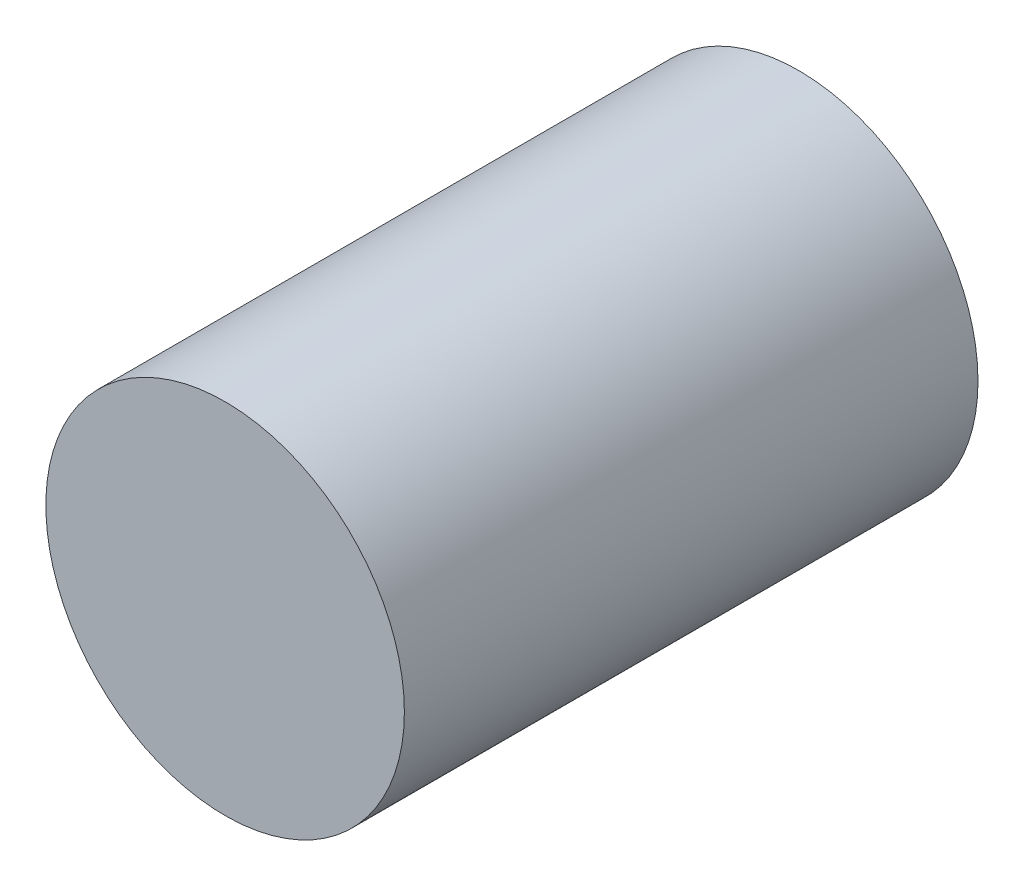
ISO-10303-21;
HEADER;
FILE_DESCRIPTION(('STEP AP214'),'2;1');
FILE_NAME('part.step','',(''),(''),'','','');
FILE_SCHEMA(('AUTOMOTIVE_DESIGN { 1 0 10303 214 1 1 1 1 }'));
ENDSEC;
DATA;
#1=APPLICATION_CONTEXT('core data for automotive mechanical design processes');
#2=APPLICATION_PROTOCOL_DEFINITION('international standard','automotive_design',2000,#1);
#3=PRODUCT_CONTEXT('',#1,'mechanical');
#4=PRODUCT('Part','Part','',(#3));
#5=PRODUCT_RELATED_PRODUCT_CATEGORY('part','',(#4));
#6=PRODUCT_DEFINITION_FORMATION('','',#4);
#7=PRODUCT_DEFINITION_CONTEXT('part definition',#1,'design');
#8=PRODUCT_DEFINITION('design','',#6,#7);
#9=PRODUCT_DEFINITION_SHAPE('','',#8);
#10=(LENGTH_UNIT() NAMED_UNIT(*) SI_UNIT(.MILLI.,.METRE.));
#11=(NAMED_UNIT(*) PLANE_ANGLE_UNIT() SI_UNIT($,.RADIAN.));
#12=(NAMED_UNIT(*) SI_UNIT($,.STERADIAN.) SOLID_ANGLE_UNIT());
#13=UNCERTAINTY_MEASURE_WITH_UNIT(LENGTH_MEASURE(1.E-05),#10,'distance_accuracy_value','');
#14=(GEOMETRIC_REPRESENTATION_CONTEXT(3) GLOBAL_UNCERTAINTY_ASSIGNED_CONTEXT((#13)) GLOBAL_UNIT_ASSIGNED_CONTEXT((#10,
#11,#12)) REPRESENTATION_CONTEXT('',''));
#15=CARTESIAN_POINT('',(0.,0.,0.));
#16=DIRECTION('',(0.,0.,1.));
#17=DIRECTION('',(1.,0.,0.));
#18=AXIS2_PLACEMENT_3D('',#15,#16,#17);
#19=CARTESIAN_POINT('',(0.,0.,80.));
#20=DIRECTION('',(0.,0.,-1.));
#21=DIRECTION('',(-1.,0.,0.));
#22=AXIS2_PLACEMENT_3D('',#19,#20,#21);
#23=CYLINDRICAL_SURFACE('',#22,25.);
#24=CARTESIAN_POINT('',(0.,0.,80.));
#25=DIRECTION('',(0.,0.,1.));
#26=DIRECTION('',(1.,0.,0.));
#27=AXIS2_PLACEMENT_3D('',#24,#25,#26);
#28=CIRCLE('',#27,25.);
#29=CARTESIAN_POINT('',(25.,0.,80.));
#30=VERTEX_POINT('',#29);
#31=EDGE_CURVE('E10',#30,#30,#28,.T.);
#32=ORIENTED_EDGE('',*,*,#31,.F.);
#33=EDGE_LOOP('',(#32));
#34=FACE_BOUND('',#33,.T.);
#35=CARTESIAN_POINT('',(0.,0.,0.));
#36=DIRECTION('',(0.,0.,1.));
#37=DIRECTION('',(1.,0.,0.));
#38=AXIS2_PLACEMENT_3D('',#35,#36,#37);
#39=CIRCLE('',#38,25.);
#40=CARTESIAN_POINT('',(25.,0.,0.));
#41=VERTEX_POINT('',#40);
#42=EDGE_CURVE('E36',#41,#41,#39,.T.);
#43=ORIENTED_EDGE('',*,*,#42,.T.);
#44=EDGE_LOOP('',(#43));
#45=FACE_BOUND('',#44,.T.);
#46=ADVANCED_FACE('F33',(#34,#45),#23,.T.);
#47=CARTESIAN_POINT('',(0.,0.,80.));
#48=DIRECTION('',(0.,0.,1.));
#49=DIRECTION('',(1.,0.,0.));
#50=AXIS2_PLACEMENT_3D('',#47,#48,#49);
#51=PLANE('',#50);
#52=ORIENTED_EDGE('',*,*,#31,.T.);
#53=EDGE_LOOP('',(#52));
#54=FACE_BOUND('',#53,.T.);
#55=ADVANCED_FACE('F48',(#54),#51,.T.);
#56=CARTESIAN_POINT('',(0.,0.,0.));
#57=DIRECTION('',(0.,0.,1.));
#58=DIRECTION('',(1.,0.,0.));
#59=AXIS2_PLACEMENT_3D('',#56,#57,#58);
#60=PLANE('',#59);
#61=ORIENTED_EDGE('',*,*,#42,.F.);
#62=EDGE_LOOP('',(#61));
#63=FACE_BOUND('',#62,.T.);
#64=ADVANCED_FACE('F46',(#63),#60,.F.);
#65=CLOSED_SHELL('',(#46,#55,#64));
#66=MANIFOLD_SOLID_BREP('B2',#65);
#67=ADVANCED_BREP_SHAPE_REPRESENTATION('',(#18,#66),#14);
#68=SHAPE_DEFINITION_REPRESENTATION(#9,#67);
ENDSEC;
END-ISO-10303-21;
